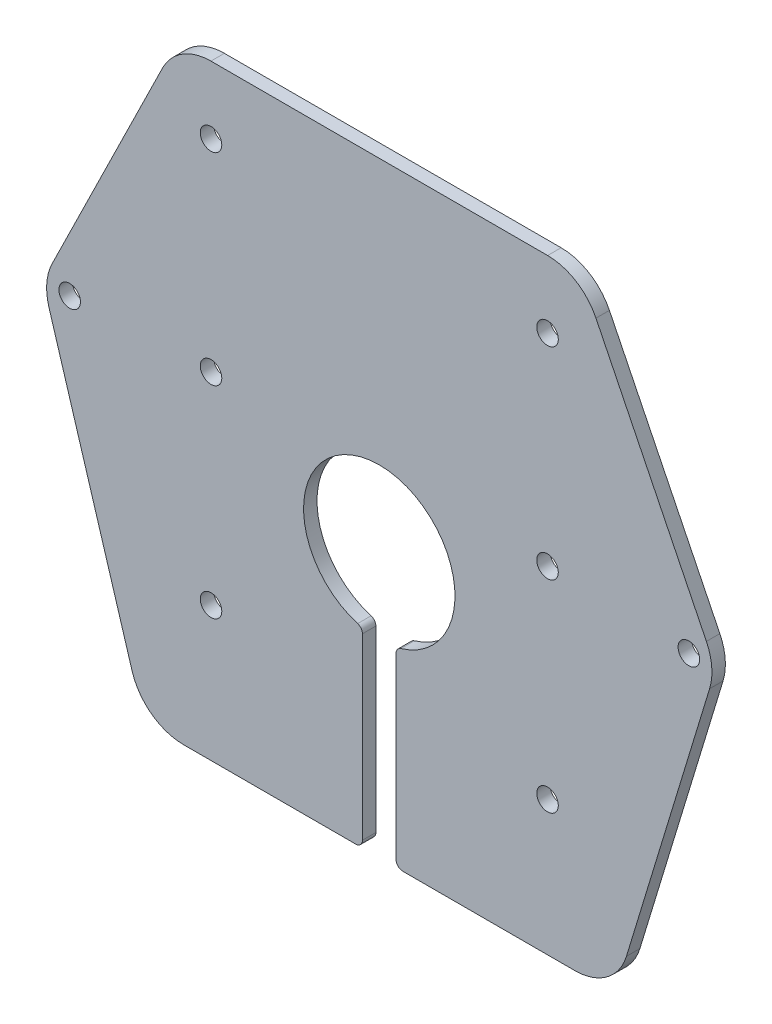
ISO-10303-21;
HEADER;
FILE_DESCRIPTION(('STEP AP214'),'2;1');
FILE_NAME('part.step','',(''),(''),'','','');
FILE_SCHEMA(('AUTOMOTIVE_DESIGN { 1 0 10303 214 1 1 1 1 }'));
ENDSEC;
DATA;
#1=APPLICATION_CONTEXT('core data for automotive mechanical design processes');
#2=APPLICATION_PROTOCOL_DEFINITION('international standard','automotive_design',2000,#1);
#3=PRODUCT_CONTEXT('',#1,'mechanical');
#4=PRODUCT('Part','Part','',(#3));
#5=PRODUCT_RELATED_PRODUCT_CATEGORY('part','',(#4));
#6=PRODUCT_DEFINITION_FORMATION('','',#4);
#7=PRODUCT_DEFINITION_CONTEXT('part definition',#1,'design');
#8=PRODUCT_DEFINITION('design','',#6,#7);
#9=PRODUCT_DEFINITION_SHAPE('','',#8);
#10=(LENGTH_UNIT() NAMED_UNIT(*) SI_UNIT(.MILLI.,.METRE.));
#11=(NAMED_UNIT(*) PLANE_ANGLE_UNIT() SI_UNIT($,.RADIAN.));
#12=(NAMED_UNIT(*) SI_UNIT($,.STERADIAN.) SOLID_ANGLE_UNIT());
#13=UNCERTAINTY_MEASURE_WITH_UNIT(LENGTH_MEASURE(1.E-05),#10,'distance_accuracy_value','');
#14=(GEOMETRIC_REPRESENTATION_CONTEXT(3) GLOBAL_UNCERTAINTY_ASSIGNED_CONTEXT((#13)) GLOBAL_UNIT_ASSIGNED_CONTEXT((#10,
#11,#12)) REPRESENTATION_CONTEXT('',''));
#15=CARTESIAN_POINT('',(0.,0.,0.));
#16=DIRECTION('',(0.,0.,1.));
#17=DIRECTION('',(1.,0.,0.));
#18=AXIS2_PLACEMENT_3D('',#15,#16,#17);
#19=CARTESIAN_POINT('',(35.,-90.,2.));
#20=DIRECTION('',(0.,1.,0.));
#21=DIRECTION('',(0.,0.,1.));
#22=AXIS2_PLACEMENT_3D('',#19,#20,#21);
#23=PLANE('',#22);
#24=DIRECTION('',(1.,0.,0.));
#25=VECTOR('',#24,1.);
#26=CARTESIAN_POINT('',(35.,-90.,0.));
#27=LINE('',#26,#25);
#28=CARTESIAN_POINT('',(-29.0719761931437,-90.,0.));
#29=VERTEX_POINT('',#28);
#30=CARTESIAN_POINT('',(-3.49999999999999,-90.,0.));
#31=VERTEX_POINT('',#30);
#32=EDGE_CURVE('E223',#29,#31,#27,.T.);
#33=ORIENTED_EDGE('',*,*,#32,.T.);
#34=DIRECTION('',(0.,0.,-1.));
#35=VECTOR('',#34,1.);
#36=CARTESIAN_POINT('',(-3.49999999999999,-90.,2.));
#37=LINE('',#36,#35);
#38=CARTESIAN_POINT('',(-3.49999999999999,-90.,2.));
#39=VERTEX_POINT('',#38);
#40=EDGE_CURVE('E12',#31,#39,#37,.F.);
#41=ORIENTED_EDGE('',*,*,#40,.T.);
#42=DIRECTION('',(1.,0.,0.));
#43=VECTOR('',#42,1.);
#44=CARTESIAN_POINT('',(35.,-90.,2.));
#45=LINE('',#44,#43);
#46=CARTESIAN_POINT('',(-29.0719761931437,-90.,2.));
#47=VERTEX_POINT('',#46);
#48=EDGE_CURVE('E329',#47,#39,#45,.T.);
#49=ORIENTED_EDGE('',*,*,#48,.F.);
#50=DIRECTION('',(0.,0.,-1.));
#51=VECTOR('',#50,1.);
#52=CARTESIAN_POINT('',(-29.0719761931437,-90.,2.));
#53=LINE('',#52,#51);
#54=EDGE_CURVE('E203',#47,#29,#53,.T.);
#55=ORIENTED_EDGE('',*,*,#54,.T.);
#56=EDGE_LOOP('',(#33,#41,#49,#55));
#57=FACE_BOUND('',#56,.T.);
#58=ADVANCED_FACE('F55',(#57),#23,.F.);
#59=CARTESIAN_POINT('',(0.,0.,2.));
#60=DIRECTION('',(0.,0.,-1.));
#61=DIRECTION('',(-1.,0.,0.));
#62=AXIS2_PLACEMENT_3D('',#59,#60,#61);
#63=PLANE('',#62);
#64=CARTESIAN_POINT('',(0.,-50.7,2.));
#65=DIRECTION('',(0.,0.,1.));
#66=DIRECTION('',(1.,0.,0.));
#67=AXIS2_PLACEMENT_3D('',#64,#65,#66);
#68=CIRCLE('',#67,11.25);
#69=CARTESIAN_POINT('',(3.21428571428572,-61.481042034374,2.));
#70=VERTEX_POINT('',#69);
#71=CARTESIAN_POINT('',(-3.21428571428571,-61.481042034374,2.));
#72=VERTEX_POINT('',#71);
#73=EDGE_CURVE('E392',#70,#72,#68,.T.);
#74=ORIENTED_EDGE('',*,*,#73,.F.);
#75=CARTESIAN_POINT('',(3.50000000000001,-62.4393568818739,2.));
#76=DIRECTION('',(0.,0.,-1.));
#77=DIRECTION('',(-1.,0.,0.));
#78=AXIS2_PLACEMENT_3D('',#75,#76,#77);
#79=CIRCLE('',#78,1.);
#80=CARTESIAN_POINT('',(2.50000000000001,-62.4393568818739,2.));
#81=VERTEX_POINT('',#80);
#82=EDGE_CURVE('E289',#70,#81,#79,.F.);
#83=ORIENTED_EDGE('',*,*,#82,.T.);
#84=DIRECTION('',(0.,1.,0.));
#85=VECTOR('',#84,1.);
#86=CARTESIAN_POINT('',(2.5,0.,2.));
#87=LINE('',#86,#85);
#88=CARTESIAN_POINT('',(2.50000000000001,-89.,2.));
#89=VERTEX_POINT('',#88);
#90=EDGE_CURVE('E391',#89,#81,#87,.T.);
#91=ORIENTED_EDGE('',*,*,#90,.F.);
#92=CARTESIAN_POINT('',(3.50000000000001,-89.,2.));
#93=DIRECTION('',(0.,0.,-1.));
#94=DIRECTION('',(-1.,0.,0.));
#95=AXIS2_PLACEMENT_3D('',#92,#93,#94);
#96=CIRCLE('',#95,1.);
#97=CARTESIAN_POINT('',(3.50000000000001,-90.,2.));
#98=VERTEX_POINT('',#97);
#99=EDGE_CURVE('E285',#89,#98,#96,.F.);
#100=ORIENTED_EDGE('',*,*,#99,.T.);
#101=CARTESIAN_POINT('',(29.0719761931437,-90.,2.));
#102=VERTEX_POINT('',#101);
#103=EDGE_CURVE('E309',#98,#102,#45,.T.);
#104=ORIENTED_EDGE('',*,*,#103,.T.);
#105=CARTESIAN_POINT('',(29.0719761931437,-82.,2.));
#106=DIRECTION('',(0.,0.,-1.));
#107=DIRECTION('',(-1.,0.,0.));
#108=AXIS2_PLACEMENT_3D('',#105,#106,#107);
#109=CIRCLE('',#108,8.);
#110=CARTESIAN_POINT('',(36.7255552246317,-84.3286751617104,2.));
#111=VERTEX_POINT('',#110);
#112=EDGE_CURVE('E253',#102,#111,#109,.F.);
#113=ORIENTED_EDGE('',*,*,#112,.T.);
#114=DIRECTION('',(0.291084395213794,0.956697378936004,0.));
#115=VECTOR('',#114,1.);
#116=CARTESIAN_POINT('',(50.,-40.7,2.));
#117=LINE('',#116,#115);
#118=CARTESIAN_POINT('',(49.08054040478,-43.7219572029563,2.));
#119=VERTEX_POINT('',#118);
#120=EDGE_CURVE('E213',#111,#119,#117,.T.);
#121=ORIENTED_EDGE('',*,*,#120,.T.);
#122=CARTESIAN_POINT('',(41.426961373292,-41.393282041246,2.));
#123=DIRECTION('',(0.,0.,-1.));
#124=DIRECTION('',(-1.,0.,0.));
#125=AXIS2_PLACEMENT_3D('',#122,#123,#124);
#126=CIRCLE('',#125,8.);
#127=CARTESIAN_POINT('',(48.6069060053251,-37.8650537208366,2.));
#128=VERTEX_POINT('',#127);
#129=EDGE_CURVE('E245',#119,#128,#126,.F.);
#130=ORIENTED_EDGE('',*,*,#129,.T.);
#131=DIRECTION('',(-0.441028540051174,0.897493079004139,0.));
#132=VECTOR('',#131,1.);
#133=CARTESIAN_POINT('',(30.,0.,2.));
#134=LINE('',#133,#132);
#135=CARTESIAN_POINT('',(32.1974308007816,-4.4717716795906,2.));
#136=VERTEX_POINT('',#135);
#137=EDGE_CURVE('E222',#128,#136,#134,.T.);
#138=ORIENTED_EDGE('',*,*,#137,.T.);
#139=CARTESIAN_POINT('',(25.0174861687485,-8.,2.));
#140=DIRECTION('',(0.,0.,-1.));
#141=DIRECTION('',(-1.,0.,0.));
#142=AXIS2_PLACEMENT_3D('',#139,#140,#141);
#143=CIRCLE('',#142,8.);
#144=CARTESIAN_POINT('',(25.0174861687485,0.,2.));
#145=VERTEX_POINT('',#144);
#146=EDGE_CURVE('E249',#136,#145,#143,.F.);
#147=ORIENTED_EDGE('',*,*,#146,.T.);
#148=DIRECTION('',(-1.,0.,0.));
#149=VECTOR('',#148,1.);
#150=CARTESIAN_POINT('',(-30.,0.,2.));
#151=LINE('',#150,#149);
#152=CARTESIAN_POINT('',(-25.0174861687485,0.,2.));
#153=VERTEX_POINT('',#152);
#154=EDGE_CURVE('E226',#145,#153,#151,.T.);
#155=ORIENTED_EDGE('',*,*,#154,.T.);
#156=CARTESIAN_POINT('',(-25.0174861687485,-8.,2.));
#157=DIRECTION('',(0.,0.,-1.));
#158=DIRECTION('',(-1.,0.,0.));
#159=AXIS2_PLACEMENT_3D('',#156,#157,#158);
#160=CIRCLE('',#159,8.);
#161=CARTESIAN_POINT('',(-32.1974308007816,-4.4717716795906,2.));
#162=VERTEX_POINT('',#161);
#163=EDGE_CURVE('E247',#153,#162,#160,.F.);
#164=ORIENTED_EDGE('',*,*,#163,.T.);
#165=DIRECTION('',(-0.441028540051174,-0.897493079004139,0.));
#166=VECTOR('',#165,1.);
#167=CARTESIAN_POINT('',(-30.,0.,2.));
#168=LINE('',#167,#166);
#169=CARTESIAN_POINT('',(-48.6069060053251,-37.8650537208366,2.));
#170=VERTEX_POINT('',#169);
#171=EDGE_CURVE('E335',#162,#170,#168,.T.);
#172=ORIENTED_EDGE('',*,*,#171,.T.);
#173=CARTESIAN_POINT('',(-41.426961373292,-41.393282041246,2.));
#174=DIRECTION('',(0.,0.,-1.));
#175=DIRECTION('',(-1.,0.,0.));
#176=AXIS2_PLACEMENT_3D('',#173,#174,#175);
#177=CIRCLE('',#176,8.);
#178=CARTESIAN_POINT('',(-49.08054040478,-43.7219572029563,2.));
#179=VERTEX_POINT('',#178);
#180=EDGE_CURVE('E243',#170,#179,#177,.F.);
#181=ORIENTED_EDGE('',*,*,#180,.T.);
#182=DIRECTION('',(0.291084395213794,-0.956697378936004,0.));
#183=VECTOR('',#182,1.);
#184=CARTESIAN_POINT('',(-50.,-40.7,2.));
#185=LINE('',#184,#183);
#186=CARTESIAN_POINT('',(-36.7255552246317,-84.3286751617104,2.));
#187=VERTEX_POINT('',#186);
#188=EDGE_CURVE('E332',#179,#187,#185,.T.);
#189=ORIENTED_EDGE('',*,*,#188,.T.);
#190=CARTESIAN_POINT('',(-29.0719761931437,-82.,2.));
#191=DIRECTION('',(0.,0.,-1.));
#192=DIRECTION('',(-1.,0.,0.));
#193=AXIS2_PLACEMENT_3D('',#190,#191,#192);
#194=CIRCLE('',#193,8.);
#195=EDGE_CURVE('E251',#187,#47,#194,.F.);
#196=ORIENTED_EDGE('',*,*,#195,.T.);
#197=ORIENTED_EDGE('',*,*,#48,.T.);
#198=CARTESIAN_POINT('',(-3.49999999999999,-89.,2.));
#199=DIRECTION('',(0.,0.,-1.));
#200=DIRECTION('',(-1.,0.,0.));
#201=AXIS2_PLACEMENT_3D('',#198,#199,#200);
#202=CIRCLE('',#201,1.);
#203=CARTESIAN_POINT('',(-2.49999999999999,-89.,2.));
#204=VERTEX_POINT('',#203);
#205=EDGE_CURVE('E283',#39,#204,#202,.F.);
#206=ORIENTED_EDGE('',*,*,#205,.T.);
#207=DIRECTION('',(0.,1.,0.));
#208=VECTOR('',#207,1.);
#209=CARTESIAN_POINT('',(-2.5,0.,2.));
#210=LINE('',#209,#208);
#211=CARTESIAN_POINT('',(-2.49999999999999,-62.4393568818739,2.));
#212=VERTEX_POINT('',#211);
#213=EDGE_CURVE('E395',#204,#212,#210,.T.);
#214=ORIENTED_EDGE('',*,*,#213,.T.);
#215=CARTESIAN_POINT('',(-3.49999999999999,-62.4393568818739,2.));
#216=DIRECTION('',(0.,0.,-1.));
#217=DIRECTION('',(-1.,0.,0.));
#218=AXIS2_PLACEMENT_3D('',#215,#216,#217);
#219=CIRCLE('',#218,1.);
#220=EDGE_CURVE('E287',#212,#72,#219,.F.);
#221=ORIENTED_EDGE('',*,*,#220,.T.);
#222=EDGE_LOOP('',(#74,#83,#91,#100,#104,#113,#121,#130,#138,#147,#155,#164,#172,#181,#189,#196,
#197,#206,#214,#221));
#223=FACE_BOUND('',#222,.T.);
#224=CARTESIAN_POINT('',(-25.,-9.99999999999999,2.));
#225=DIRECTION('',(0.,0.,1.));
#226=DIRECTION('',(1.,0.,0.));
#227=AXIS2_PLACEMENT_3D('',#224,#225,#226);
#228=CIRCLE('',#227,1.6);
#229=CARTESIAN_POINT('',(-23.4,-9.99999999999999,2.));
#230=VERTEX_POINT('',#229);
#231=EDGE_CURVE('E327',#230,#230,#228,.T.);
#232=ORIENTED_EDGE('',*,*,#231,.F.);
#233=EDGE_LOOP('',(#232));
#234=FACE_BOUND('',#233,.T.);
#235=CARTESIAN_POINT('',(-46.,-40.7,2.));
#236=DIRECTION('',(0.,0.,1.));
#237=DIRECTION('',(1.,0.,0.));
#238=AXIS2_PLACEMENT_3D('',#235,#236,#237);
#239=CIRCLE('',#238,1.6);
#240=CARTESIAN_POINT('',(-44.4,-40.7,2.));
#241=VERTEX_POINT('',#240);
#242=EDGE_CURVE('E343',#241,#241,#239,.T.);
#243=ORIENTED_EDGE('',*,*,#242,.F.);
#244=EDGE_LOOP('',(#243));
#245=FACE_BOUND('',#244,.T.);
#246=CARTESIAN_POINT('',(25.,-9.99999999999999,2.));
#247=DIRECTION('',(0.,0.,1.));
#248=DIRECTION('',(-1.,0.,0.));
#249=AXIS2_PLACEMENT_3D('',#246,#247,#248);
#250=CIRCLE('',#249,1.6);
#251=CARTESIAN_POINT('',(23.4,-9.99999999999999,2.));
#252=VERTEX_POINT('',#251);
#253=EDGE_CURVE('E349',#252,#252,#250,.T.);
#254=ORIENTED_EDGE('',*,*,#253,.F.);
#255=EDGE_LOOP('',(#254));
#256=FACE_BOUND('',#255,.T.);
#257=CARTESIAN_POINT('',(46.,-40.7,2.));
#258=DIRECTION('',(0.,0.,1.));
#259=DIRECTION('',(-1.,0.,0.));
#260=AXIS2_PLACEMENT_3D('',#257,#258,#259);
#261=CIRCLE('',#260,1.6);
#262=CARTESIAN_POINT('',(44.4,-40.7,2.));
#263=VERTEX_POINT('',#262);
#264=EDGE_CURVE('E355',#263,#263,#261,.T.);
#265=ORIENTED_EDGE('',*,*,#264,.F.);
#266=EDGE_LOOP('',(#265));
#267=FACE_BOUND('',#266,.T.);
#268=CARTESIAN_POINT('',(-25.,-40.,2.));
#269=DIRECTION('',(0.,0.,1.));
#270=DIRECTION('',(1.,0.,0.));
#271=AXIS2_PLACEMENT_3D('',#268,#269,#270);
#272=CIRCLE('',#271,1.6);
#273=CARTESIAN_POINT('',(-23.4,-40.,2.));
#274=VERTEX_POINT('',#273);
#275=EDGE_CURVE('E361',#274,#274,#272,.T.);
#276=ORIENTED_EDGE('',*,*,#275,.F.);
#277=EDGE_LOOP('',(#276));
#278=FACE_BOUND('',#277,.T.);
#279=CARTESIAN_POINT('',(25.,-40.,2.));
#280=DIRECTION('',(0.,0.,1.));
#281=DIRECTION('',(1.,0.,0.));
#282=AXIS2_PLACEMENT_3D('',#279,#280,#281);
#283=CIRCLE('',#282,1.6);
#284=CARTESIAN_POINT('',(26.6,-40.,2.));
#285=VERTEX_POINT('',#284);
#286=EDGE_CURVE('E367',#285,#285,#283,.T.);
#287=ORIENTED_EDGE('',*,*,#286,.F.);
#288=EDGE_LOOP('',(#287));
#289=FACE_BOUND('',#288,.T.);
#290=CARTESIAN_POINT('',(-25.,-70.,2.));
#291=DIRECTION('',(0.,0.,1.));
#292=DIRECTION('',(1.,0.,0.));
#293=AXIS2_PLACEMENT_3D('',#290,#291,#292);
#294=CIRCLE('',#293,1.60000000000001);
#295=CARTESIAN_POINT('',(-23.4,-70.,2.));
#296=VERTEX_POINT('',#295);
#297=EDGE_CURVE('E373',#296,#296,#294,.T.);
#298=ORIENTED_EDGE('',*,*,#297,.F.);
#299=EDGE_LOOP('',(#298));
#300=FACE_BOUND('',#299,.T.);
#301=CARTESIAN_POINT('',(25.,-70.,2.));
#302=DIRECTION('',(0.,0.,1.));
#303=DIRECTION('',(-1.,0.,0.));
#304=AXIS2_PLACEMENT_3D('',#301,#302,#303);
#305=CIRCLE('',#304,1.60000000000001);
#306=CARTESIAN_POINT('',(23.4,-70.,2.));
#307=VERTEX_POINT('',#306);
#308=EDGE_CURVE('E379',#307,#307,#305,.T.);
#309=ORIENTED_EDGE('',*,*,#308,.F.);
#310=EDGE_LOOP('',(#309));
#311=FACE_BOUND('',#310,.T.);
#312=ADVANCED_FACE('F402',(#223,#234,#245,#256,#267,#278,#289,#300,#311),#63,.F.);
#313=CARTESIAN_POINT('',(0.,0.,0.));
#314=DIRECTION('',(0.,0.,-1.));
#315=DIRECTION('',(-1.,0.,0.));
#316=AXIS2_PLACEMENT_3D('',#313,#314,#315);
#317=PLANE('',#316);
#318=DIRECTION('',(0.,-1.,0.));
#319=VECTOR('',#318,1.);
#320=CARTESIAN_POINT('',(2.5,0.,0.));
#321=LINE('',#320,#319);
#322=CARTESIAN_POINT('',(2.50000000000001,-62.4393568818739,0.));
#323=VERTEX_POINT('',#322);
#324=CARTESIAN_POINT('',(2.50000000000001,-89.,0.));
#325=VERTEX_POINT('',#324);
#326=EDGE_CURVE('E385',#323,#325,#321,.T.);
#327=ORIENTED_EDGE('',*,*,#326,.F.);
#328=CARTESIAN_POINT('',(3.50000000000001,-62.4393568818739,0.));
#329=DIRECTION('',(0.,0.,-1.));
#330=DIRECTION('',(-1.,0.,0.));
#331=AXIS2_PLACEMENT_3D('',#328,#329,#330);
#332=CIRCLE('',#331,1.);
#333=CARTESIAN_POINT('',(3.21428571428572,-61.481042034374,0.));
#334=VERTEX_POINT('',#333);
#335=EDGE_CURVE('E299',#323,#334,#332,.T.);
#336=ORIENTED_EDGE('',*,*,#335,.T.);
#337=CARTESIAN_POINT('',(0.,-50.7,0.));
#338=DIRECTION('',(0.,0.,-1.));
#339=DIRECTION('',(-1.,0.,0.));
#340=AXIS2_PLACEMENT_3D('',#337,#338,#339);
#341=CIRCLE('',#340,11.25);
#342=CARTESIAN_POINT('',(-3.21428571428571,-61.481042034374,0.));
#343=VERTEX_POINT('',#342);
#344=EDGE_CURVE('E275',#343,#334,#341,.T.);
#345=ORIENTED_EDGE('',*,*,#344,.F.);
#346=CARTESIAN_POINT('',(-3.49999999999999,-62.4393568818739,0.));
#347=DIRECTION('',(0.,0.,-1.));
#348=DIRECTION('',(-1.,0.,0.));
#349=AXIS2_PLACEMENT_3D('',#346,#347,#348);
#350=CIRCLE('',#349,1.);
#351=CARTESIAN_POINT('',(-2.49999999999999,-62.4393568818739,0.));
#352=VERTEX_POINT('',#351);
#353=EDGE_CURVE('E297',#343,#352,#350,.T.);
#354=ORIENTED_EDGE('',*,*,#353,.T.);
#355=DIRECTION('',(0.,-1.,0.));
#356=VECTOR('',#355,1.);
#357=CARTESIAN_POINT('',(-2.5,0.,0.));
#358=LINE('',#357,#356);
#359=CARTESIAN_POINT('',(-2.49999999999999,-89.,0.));
#360=VERTEX_POINT('',#359);
#361=EDGE_CURVE('E389',#352,#360,#358,.T.);
#362=ORIENTED_EDGE('',*,*,#361,.T.);
#363=CARTESIAN_POINT('',(-3.49999999999999,-89.,0.));
#364=DIRECTION('',(0.,0.,-1.));
#365=DIRECTION('',(-1.,0.,0.));
#366=AXIS2_PLACEMENT_3D('',#363,#364,#365);
#367=CIRCLE('',#366,1.);
#368=EDGE_CURVE('E78',#360,#31,#367,.T.);
#369=ORIENTED_EDGE('',*,*,#368,.T.);
#370=ORIENTED_EDGE('',*,*,#32,.F.);
#371=CARTESIAN_POINT('',(-29.0719761931437,-82.,0.));
#372=DIRECTION('',(0.,0.,-1.));
#373=DIRECTION('',(-1.,0.,0.));
#374=AXIS2_PLACEMENT_3D('',#371,#372,#373);
#375=CIRCLE('',#374,8.);
#376=CARTESIAN_POINT('',(-36.7255552246317,-84.3286751617104,0.));
#377=VERTEX_POINT('',#376);
#378=EDGE_CURVE('E204',#29,#377,#375,.T.);
#379=ORIENTED_EDGE('',*,*,#378,.T.);
#380=DIRECTION('',(0.291084395213794,-0.956697378936004,0.));
#381=VECTOR('',#380,1.);
#382=CARTESIAN_POINT('',(-50.,-40.7,0.));
#383=LINE('',#382,#381);
#384=CARTESIAN_POINT('',(-49.08054040478,-43.7219572029563,0.));
#385=VERTEX_POINT('',#384);
#386=EDGE_CURVE('E312',#385,#377,#383,.T.);
#387=ORIENTED_EDGE('',*,*,#386,.F.);
#388=CARTESIAN_POINT('',(-41.426961373292,-41.393282041246,0.));
#389=DIRECTION('',(0.,0.,-1.));
#390=DIRECTION('',(-1.,0.,0.));
#391=AXIS2_PLACEMENT_3D('',#388,#389,#390);
#392=CIRCLE('',#391,8.);
#393=CARTESIAN_POINT('',(-48.6069060053251,-37.8650537208366,0.));
#394=VERTEX_POINT('',#393);
#395=EDGE_CURVE('E214',#385,#394,#392,.T.);
#396=ORIENTED_EDGE('',*,*,#395,.T.);
#397=DIRECTION('',(-0.441028540051174,-0.897493079004139,0.));
#398=VECTOR('',#397,1.);
#399=CARTESIAN_POINT('',(-30.,0.,0.));
#400=LINE('',#399,#398);
#401=CARTESIAN_POINT('',(-32.1974308007816,-4.4717716795906,0.));
#402=VERTEX_POINT('',#401);
#403=EDGE_CURVE('E314',#402,#394,#400,.T.);
#404=ORIENTED_EDGE('',*,*,#403,.F.);
#405=CARTESIAN_POINT('',(-25.0174861687485,-8.,0.));
#406=DIRECTION('',(0.,0.,-1.));
#407=DIRECTION('',(-1.,0.,0.));
#408=AXIS2_PLACEMENT_3D('',#405,#406,#407);
#409=CIRCLE('',#408,8.);
#410=CARTESIAN_POINT('',(-25.0174861687485,0.,0.));
#411=VERTEX_POINT('',#410);
#412=EDGE_CURVE('E235',#402,#411,#409,.T.);
#413=ORIENTED_EDGE('',*,*,#412,.T.);
#414=DIRECTION('',(-1.,0.,0.));
#415=VECTOR('',#414,1.);
#416=CARTESIAN_POINT('',(-30.,0.,0.));
#417=LINE('',#416,#415);
#418=CARTESIAN_POINT('',(25.0174861687485,0.,0.));
#419=VERTEX_POINT('',#418);
#420=EDGE_CURVE('E319',#419,#411,#417,.T.);
#421=ORIENTED_EDGE('',*,*,#420,.F.);
#422=CARTESIAN_POINT('',(25.0174861687485,-8.,0.));
#423=DIRECTION('',(0.,0.,-1.));
#424=DIRECTION('',(-1.,0.,0.));
#425=AXIS2_PLACEMENT_3D('',#422,#423,#424);
#426=CIRCLE('',#425,8.);
#427=CARTESIAN_POINT('',(32.1974308007816,-4.4717716795906,0.));
#428=VERTEX_POINT('',#427);
#429=EDGE_CURVE('E237',#419,#428,#426,.T.);
#430=ORIENTED_EDGE('',*,*,#429,.T.);
#431=DIRECTION('',(-0.441028540051174,0.897493079004139,0.));
#432=VECTOR('',#431,1.);
#433=CARTESIAN_POINT('',(30.,0.,0.));
#434=LINE('',#433,#432);
#435=CARTESIAN_POINT('',(48.6069060053251,-37.8650537208366,0.));
#436=VERTEX_POINT('',#435);
#437=EDGE_CURVE('E324',#436,#428,#434,.T.);
#438=ORIENTED_EDGE('',*,*,#437,.F.);
#439=CARTESIAN_POINT('',(41.426961373292,-41.393282041246,0.));
#440=DIRECTION('',(0.,0.,-1.));
#441=DIRECTION('',(-1.,0.,0.));
#442=AXIS2_PLACEMENT_3D('',#439,#440,#441);
#443=CIRCLE('',#442,8.);
#444=CARTESIAN_POINT('',(49.08054040478,-43.7219572029563,0.));
#445=VERTEX_POINT('',#444);
#446=EDGE_CURVE('E221',#436,#445,#443,.T.);
#447=ORIENTED_EDGE('',*,*,#446,.T.);
#448=DIRECTION('',(0.291084395213794,0.956697378936004,0.));
#449=VECTOR('',#448,1.);
#450=CARTESIAN_POINT('',(50.,-40.7,0.));
#451=LINE('',#450,#449);
#452=CARTESIAN_POINT('',(36.7255552246317,-84.3286751617104,0.));
#453=VERTEX_POINT('',#452);
#454=EDGE_CURVE('E210',#453,#445,#451,.T.);
#455=ORIENTED_EDGE('',*,*,#454,.F.);
#456=CARTESIAN_POINT('',(29.0719761931437,-82.,0.));
#457=DIRECTION('',(0.,0.,-1.));
#458=DIRECTION('',(-1.,0.,0.));
#459=AXIS2_PLACEMENT_3D('',#456,#457,#458);
#460=CIRCLE('',#459,8.);
#461=CARTESIAN_POINT('',(29.0719761931437,-90.,0.));
#462=VERTEX_POINT('',#461);
#463=EDGE_CURVE('E194',#453,#462,#460,.T.);
#464=ORIENTED_EDGE('',*,*,#463,.T.);
#465=CARTESIAN_POINT('',(3.50000000000001,-90.,0.));
#466=VERTEX_POINT('',#465);
#467=EDGE_CURVE('E228',#466,#462,#27,.T.);
#468=ORIENTED_EDGE('',*,*,#467,.F.);
#469=CARTESIAN_POINT('',(3.50000000000001,-89.,0.));
#470=DIRECTION('',(0.,0.,-1.));
#471=DIRECTION('',(-1.,0.,0.));
#472=AXIS2_PLACEMENT_3D('',#469,#470,#471);
#473=CIRCLE('',#472,1.);
#474=EDGE_CURVE('E70',#466,#325,#473,.T.);
#475=ORIENTED_EDGE('',*,*,#474,.T.);
#476=EDGE_LOOP('',(#327,#336,#345,#354,#362,#369,#370,#379,#387,#396,#404,#413,#421,#430,#438,
#447,#455,#464,#468,#475));
#477=FACE_BOUND('',#476,.T.);
#478=CARTESIAN_POINT('',(-25.,-70.,0.));
#479=DIRECTION('',(0.,0.,1.));
#480=DIRECTION('',(1.,0.,0.));
#481=AXIS2_PLACEMENT_3D('',#478,#479,#480);
#482=CIRCLE('',#481,1.60000000000001);
#483=CARTESIAN_POINT('',(-23.4,-70.,0.));
#484=VERTEX_POINT('',#483);
#485=EDGE_CURVE('E376',#484,#484,#482,.T.);
#486=ORIENTED_EDGE('',*,*,#485,.T.);
#487=EDGE_LOOP('',(#486));
#488=FACE_BOUND('',#487,.T.);
#489=CARTESIAN_POINT('',(-25.,-40.,0.));
#490=DIRECTION('',(0.,0.,1.));
#491=DIRECTION('',(1.,0.,0.));
#492=AXIS2_PLACEMENT_3D('',#489,#490,#491);
#493=CIRCLE('',#492,1.6);
#494=CARTESIAN_POINT('',(-23.4,-40.,0.));
#495=VERTEX_POINT('',#494);
#496=EDGE_CURVE('E364',#495,#495,#493,.T.);
#497=ORIENTED_EDGE('',*,*,#496,.T.);
#498=EDGE_LOOP('',(#497));
#499=FACE_BOUND('',#498,.T.);
#500=CARTESIAN_POINT('',(25.,-9.99999999999999,0.));
#501=DIRECTION('',(0.,0.,1.));
#502=DIRECTION('',(-1.,0.,0.));
#503=AXIS2_PLACEMENT_3D('',#500,#501,#502);
#504=CIRCLE('',#503,1.6);
#505=CARTESIAN_POINT('',(23.4,-9.99999999999999,0.));
#506=VERTEX_POINT('',#505);
#507=EDGE_CURVE('E352',#506,#506,#504,.T.);
#508=ORIENTED_EDGE('',*,*,#507,.T.);
#509=EDGE_LOOP('',(#508));
#510=FACE_BOUND('',#509,.T.);
#511=CARTESIAN_POINT('',(-25.,-9.99999999999999,0.));
#512=DIRECTION('',(0.,0.,1.));
#513=DIRECTION('',(1.,0.,0.));
#514=AXIS2_PLACEMENT_3D('',#511,#512,#513);
#515=CIRCLE('',#514,1.6);
#516=CARTESIAN_POINT('',(-23.4,-9.99999999999999,0.));
#517=VERTEX_POINT('',#516);
#518=EDGE_CURVE('E340',#517,#517,#515,.T.);
#519=ORIENTED_EDGE('',*,*,#518,.T.);
#520=EDGE_LOOP('',(#519));
#521=FACE_BOUND('',#520,.T.);
#522=CARTESIAN_POINT('',(-46.,-40.7,0.));
#523=DIRECTION('',(0.,0.,1.));
#524=DIRECTION('',(1.,0.,0.));
#525=AXIS2_PLACEMENT_3D('',#522,#523,#524);
#526=CIRCLE('',#525,1.6);
#527=CARTESIAN_POINT('',(-44.4,-40.7,0.));
#528=VERTEX_POINT('',#527);
#529=EDGE_CURVE('E346',#528,#528,#526,.T.);
#530=ORIENTED_EDGE('',*,*,#529,.T.);
#531=EDGE_LOOP('',(#530));
#532=FACE_BOUND('',#531,.T.);
#533=CARTESIAN_POINT('',(46.,-40.7,0.));
#534=DIRECTION('',(0.,0.,1.));
#535=DIRECTION('',(-1.,0.,0.));
#536=AXIS2_PLACEMENT_3D('',#533,#534,#535);
#537=CIRCLE('',#536,1.6);
#538=CARTESIAN_POINT('',(44.4,-40.7,0.));
#539=VERTEX_POINT('',#538);
#540=EDGE_CURVE('E358',#539,#539,#537,.T.);
#541=ORIENTED_EDGE('',*,*,#540,.T.);
#542=EDGE_LOOP('',(#541));
#543=FACE_BOUND('',#542,.T.);
#544=CARTESIAN_POINT('',(25.,-40.,0.));
#545=DIRECTION('',(0.,0.,1.));
#546=DIRECTION('',(1.,0.,0.));
#547=AXIS2_PLACEMENT_3D('',#544,#545,#546);
#548=CIRCLE('',#547,1.6);
#549=CARTESIAN_POINT('',(26.6,-40.,0.));
#550=VERTEX_POINT('',#549);
#551=EDGE_CURVE('E370',#550,#550,#548,.T.);
#552=ORIENTED_EDGE('',*,*,#551,.T.);
#553=EDGE_LOOP('',(#552));
#554=FACE_BOUND('',#553,.T.);
#555=CARTESIAN_POINT('',(25.,-70.,0.));
#556=DIRECTION('',(0.,0.,1.));
#557=DIRECTION('',(-1.,0.,0.));
#558=AXIS2_PLACEMENT_3D('',#555,#556,#557);
#559=CIRCLE('',#558,1.60000000000001);
#560=CARTESIAN_POINT('',(23.4,-70.,0.));
#561=VERTEX_POINT('',#560);
#562=EDGE_CURVE('E382',#561,#561,#559,.T.);
#563=ORIENTED_EDGE('',*,*,#562,.T.);
#564=EDGE_LOOP('',(#563));
#565=FACE_BOUND('',#564,.T.);
#566=ADVANCED_FACE('F218',(#477,#488,#499,#510,#521,#532,#543,#554,#565),#317,.T.);
#567=CARTESIAN_POINT('',(30.,0.,2.));
#568=DIRECTION('',(-0.897493079004139,-0.441028540051174,0.));
#569=DIRECTION('',(0.441028540051174,-0.897493079004139,0.));
#570=AXIS2_PLACEMENT_3D('',#567,#568,#569);
#571=PLANE('',#570);
#572=ORIENTED_EDGE('',*,*,#437,.T.);
#573=DIRECTION('',(0.,0.,-1.));
#574=VECTOR('',#573,1.);
#575=CARTESIAN_POINT('',(32.1974308007816,-4.4717716795906,2.));
#576=LINE('',#575,#574);
#577=EDGE_CURVE('E268',#428,#136,#576,.F.);
#578=ORIENTED_EDGE('',*,*,#577,.T.);
#579=ORIENTED_EDGE('',*,*,#137,.F.);
#580=DIRECTION('',(0.,0.,-1.));
#581=VECTOR('',#580,1.);
#582=CARTESIAN_POINT('',(48.6069060053251,-37.8650537208366,2.));
#583=LINE('',#582,#581);
#584=EDGE_CURVE('E265',#128,#436,#583,.T.);
#585=ORIENTED_EDGE('',*,*,#584,.T.);
#586=EDGE_LOOP('',(#572,#578,#579,#585));
#587=FACE_BOUND('',#586,.T.);
#588=ADVANCED_FACE('F449',(#587),#571,.F.);
#589=CARTESIAN_POINT('',(-30.,0.,2.));
#590=DIRECTION('',(0.,-1.,0.));
#591=DIRECTION('',(0.,0.,-1.));
#592=AXIS2_PLACEMENT_3D('',#589,#590,#591);
#593=PLANE('',#592);
#594=ORIENTED_EDGE('',*,*,#154,.F.);
#595=DIRECTION('',(0.,0.,-1.));
#596=VECTOR('',#595,1.);
#597=CARTESIAN_POINT('',(25.0174861687485,0.,2.));
#598=LINE('',#597,#596);
#599=EDGE_CURVE('E262',#145,#419,#598,.T.);
#600=ORIENTED_EDGE('',*,*,#599,.T.);
#601=ORIENTED_EDGE('',*,*,#420,.T.);
#602=DIRECTION('',(0.,0.,-1.));
#603=VECTOR('',#602,1.);
#604=CARTESIAN_POINT('',(-25.0174861687485,0.,2.));
#605=LINE('',#604,#603);
#606=EDGE_CURVE('E260',#411,#153,#605,.F.);
#607=ORIENTED_EDGE('',*,*,#606,.T.);
#608=EDGE_LOOP('',(#594,#600,#601,#607));
#609=FACE_BOUND('',#608,.T.);
#610=ADVANCED_FACE('F437',(#609),#593,.F.);
#611=CARTESIAN_POINT('',(-30.,0.,2.));
#612=DIRECTION('',(0.897493079004139,-0.441028540051174,0.));
#613=DIRECTION('',(0.441028540051174,0.897493079004139,0.));
#614=AXIS2_PLACEMENT_3D('',#611,#612,#613);
#615=PLANE('',#614);
#616=ORIENTED_EDGE('',*,*,#171,.F.);
#617=DIRECTION('',(0.,0.,-1.));
#618=VECTOR('',#617,1.);
#619=CARTESIAN_POINT('',(-32.1974308007816,-4.47177167959061,2.));
#620=LINE('',#619,#618);
#621=EDGE_CURVE('E272',#162,#402,#620,.T.);
#622=ORIENTED_EDGE('',*,*,#621,.T.);
#623=ORIENTED_EDGE('',*,*,#403,.T.);
#624=DIRECTION('',(0.,0.,-1.));
#625=VECTOR('',#624,1.);
#626=CARTESIAN_POINT('',(-48.6069060053251,-37.8650537208366,2.));
#627=LINE('',#626,#625);
#628=EDGE_CURVE('E270',#394,#170,#627,.F.);
#629=ORIENTED_EDGE('',*,*,#628,.T.);
#630=EDGE_LOOP('',(#616,#622,#623,#629));
#631=FACE_BOUND('',#630,.T.);
#632=ADVANCED_FACE('F425',(#631),#615,.F.);
#633=CARTESIAN_POINT('',(-50.,-40.7,2.));
#634=DIRECTION('',(0.956697378936004,0.291084395213794,0.));
#635=DIRECTION('',(-0.291084395213794,0.956697378936004,0.));
#636=AXIS2_PLACEMENT_3D('',#633,#634,#635);
#637=PLANE('',#636);
#638=ORIENTED_EDGE('',*,*,#386,.T.);
#639=DIRECTION('',(0.,0.,-1.));
#640=VECTOR('',#639,1.);
#641=CARTESIAN_POINT('',(-36.7255552246317,-84.3286751617104,2.));
#642=LINE('',#641,#640);
#643=EDGE_CURVE('E258',#377,#187,#642,.F.);
#644=ORIENTED_EDGE('',*,*,#643,.T.);
#645=ORIENTED_EDGE('',*,*,#188,.F.);
#646=DIRECTION('',(0.,0.,-1.));
#647=VECTOR('',#646,1.);
#648=CARTESIAN_POINT('',(-49.08054040478,-43.7219572029563,2.));
#649=LINE('',#648,#647);
#650=EDGE_CURVE('E255',#179,#385,#649,.T.);
#651=ORIENTED_EDGE('',*,*,#650,.T.);
#652=EDGE_LOOP('',(#638,#644,#645,#651));
#653=FACE_BOUND('',#652,.T.);
#654=ADVANCED_FACE('F429',(#653),#637,.F.);
#655=ORIENTED_EDGE('',*,*,#103,.F.);
#656=DIRECTION('',(0.,0.,-1.));
#657=VECTOR('',#656,1.);
#658=CARTESIAN_POINT('',(3.50000000000001,-90.,2.));
#659=LINE('',#658,#657);
#660=EDGE_CURVE('E63',#98,#466,#659,.T.);
#661=ORIENTED_EDGE('',*,*,#660,.T.);
#662=ORIENTED_EDGE('',*,*,#467,.T.);
#663=DIRECTION('',(0.,0.,-1.));
#664=VECTOR('',#663,1.);
#665=CARTESIAN_POINT('',(29.0719761931437,-90.,2.));
#666=LINE('',#665,#664);
#667=EDGE_CURVE('E200',#462,#102,#666,.F.);
#668=ORIENTED_EDGE('',*,*,#667,.T.);
#669=EDGE_LOOP('',(#655,#661,#662,#668));
#670=FACE_BOUND('',#669,.T.);
#671=ADVANCED_FACE('F308',(#670),#23,.F.);
#672=CARTESIAN_POINT('',(50.,-40.7,2.));
#673=DIRECTION('',(-0.956697378936004,0.291084395213794,0.));
#674=DIRECTION('',(-0.291084395213794,-0.956697378936004,0.));
#675=AXIS2_PLACEMENT_3D('',#672,#673,#674);
#676=PLANE('',#675);
#677=ORIENTED_EDGE('',*,*,#120,.F.);
#678=DIRECTION('',(0.,0.,-1.));
#679=VECTOR('',#678,1.);
#680=CARTESIAN_POINT('',(36.7255552246317,-84.3286751617104,2.));
#681=LINE('',#680,#679);
#682=EDGE_CURVE('E198',#111,#453,#681,.T.);
#683=ORIENTED_EDGE('',*,*,#682,.T.);
#684=ORIENTED_EDGE('',*,*,#454,.T.);
#685=DIRECTION('',(0.,0.,-1.));
#686=VECTOR('',#685,1.);
#687=CARTESIAN_POINT('',(49.08054040478,-43.7219572029563,2.));
#688=LINE('',#687,#686);
#689=EDGE_CURVE('E215',#445,#119,#688,.F.);
#690=ORIENTED_EDGE('',*,*,#689,.T.);
#691=EDGE_LOOP('',(#677,#683,#684,#690));
#692=FACE_BOUND('',#691,.T.);
#693=ADVANCED_FACE('F209',(#692),#676,.F.);
#694=CARTESIAN_POINT('',(-25.,-9.99999999999999,2.));
#695=DIRECTION('',(0.,0.,-1.));
#696=DIRECTION('',(-1.,0.,0.));
#697=AXIS2_PLACEMENT_3D('',#694,#695,#696);
#698=CYLINDRICAL_SURFACE('',#697,1.6);
#699=ORIENTED_EDGE('',*,*,#231,.T.);
#700=EDGE_LOOP('',(#699));
#701=FACE_BOUND('',#700,.T.);
#702=ORIENTED_EDGE('',*,*,#518,.F.);
#703=EDGE_LOOP('',(#702));
#704=FACE_BOUND('',#703,.T.);
#705=ADVANCED_FACE('F447',(#701,#704),#698,.F.);
#706=CARTESIAN_POINT('',(-46.,-40.7,2.));
#707=DIRECTION('',(0.,0.,-1.));
#708=DIRECTION('',(-1.,0.,0.));
#709=AXIS2_PLACEMENT_3D('',#706,#707,#708);
#710=CYLINDRICAL_SURFACE('',#709,1.6);
#711=ORIENTED_EDGE('',*,*,#242,.T.);
#712=EDGE_LOOP('',(#711));
#713=FACE_BOUND('',#712,.T.);
#714=ORIENTED_EDGE('',*,*,#529,.F.);
#715=EDGE_LOOP('',(#714));
#716=FACE_BOUND('',#715,.T.);
#717=ADVANCED_FACE('F453',(#713,#716),#710,.F.);
#718=CARTESIAN_POINT('',(25.,-9.99999999999999,2.));
#719=DIRECTION('',(0.,0.,-1.));
#720=DIRECTION('',(-1.,0.,0.));
#721=AXIS2_PLACEMENT_3D('',#718,#719,#720);
#722=CYLINDRICAL_SURFACE('',#721,1.6);
#723=ORIENTED_EDGE('',*,*,#253,.T.);
#724=EDGE_LOOP('',(#723));
#725=FACE_BOUND('',#724,.T.);
#726=ORIENTED_EDGE('',*,*,#507,.F.);
#727=EDGE_LOOP('',(#726));
#728=FACE_BOUND('',#727,.T.);
#729=ADVANCED_FACE('F457',(#725,#728),#722,.F.);
#730=CARTESIAN_POINT('',(46.,-40.7,2.));
#731=DIRECTION('',(0.,0.,-1.));
#732=DIRECTION('',(-1.,0.,0.));
#733=AXIS2_PLACEMENT_3D('',#730,#731,#732);
#734=CYLINDRICAL_SURFACE('',#733,1.6);
#735=ORIENTED_EDGE('',*,*,#264,.T.);
#736=EDGE_LOOP('',(#735));
#737=FACE_BOUND('',#736,.T.);
#738=ORIENTED_EDGE('',*,*,#540,.F.);
#739=EDGE_LOOP('',(#738));
#740=FACE_BOUND('',#739,.T.);
#741=ADVANCED_FACE('F461',(#737,#740),#734,.F.);
#742=CARTESIAN_POINT('',(-25.,-40.,2.));
#743=DIRECTION('',(0.,0.,-1.));
#744=DIRECTION('',(-1.,0.,0.));
#745=AXIS2_PLACEMENT_3D('',#742,#743,#744);
#746=CYLINDRICAL_SURFACE('',#745,1.6);
#747=ORIENTED_EDGE('',*,*,#275,.T.);
#748=EDGE_LOOP('',(#747));
#749=FACE_BOUND('',#748,.T.);
#750=ORIENTED_EDGE('',*,*,#496,.F.);
#751=EDGE_LOOP('',(#750));
#752=FACE_BOUND('',#751,.T.);
#753=ADVANCED_FACE('F465',(#749,#752),#746,.F.);
#754=CARTESIAN_POINT('',(25.,-40.,2.));
#755=DIRECTION('',(0.,0.,-1.));
#756=DIRECTION('',(-1.,0.,0.));
#757=AXIS2_PLACEMENT_3D('',#754,#755,#756);
#758=CYLINDRICAL_SURFACE('',#757,1.6);
#759=ORIENTED_EDGE('',*,*,#286,.T.);
#760=EDGE_LOOP('',(#759));
#761=FACE_BOUND('',#760,.T.);
#762=ORIENTED_EDGE('',*,*,#551,.F.);
#763=EDGE_LOOP('',(#762));
#764=FACE_BOUND('',#763,.T.);
#765=ADVANCED_FACE('F469',(#761,#764),#758,.F.);
#766=CARTESIAN_POINT('',(-25.,-70.,2.));
#767=DIRECTION('',(0.,0.,-1.));
#768=DIRECTION('',(-1.,0.,0.));
#769=AXIS2_PLACEMENT_3D('',#766,#767,#768);
#770=CYLINDRICAL_SURFACE('',#769,1.60000000000001);
#771=ORIENTED_EDGE('',*,*,#297,.T.);
#772=EDGE_LOOP('',(#771));
#773=FACE_BOUND('',#772,.T.);
#774=ORIENTED_EDGE('',*,*,#485,.F.);
#775=EDGE_LOOP('',(#774));
#776=FACE_BOUND('',#775,.T.);
#777=ADVANCED_FACE('F473',(#773,#776),#770,.F.);
#778=CARTESIAN_POINT('',(25.,-70.,2.));
#779=DIRECTION('',(0.,0.,-1.));
#780=DIRECTION('',(-1.,0.,0.));
#781=AXIS2_PLACEMENT_3D('',#778,#779,#780);
#782=CYLINDRICAL_SURFACE('',#781,1.60000000000001);
#783=ORIENTED_EDGE('',*,*,#308,.T.);
#784=EDGE_LOOP('',(#783));
#785=FACE_BOUND('',#784,.T.);
#786=ORIENTED_EDGE('',*,*,#562,.F.);
#787=EDGE_LOOP('',(#786));
#788=FACE_BOUND('',#787,.T.);
#789=ADVANCED_FACE('F477',(#785,#788),#782,.F.);
#790=CARTESIAN_POINT('',(29.0719761931437,-82.,2.));
#791=DIRECTION('',(0.,0.,-1.));
#792=DIRECTION('',(-1.,0.,0.));
#793=AXIS2_PLACEMENT_3D('',#790,#791,#792);
#794=CYLINDRICAL_SURFACE('',#793,8.);
#795=ORIENTED_EDGE('',*,*,#112,.F.);
#796=ORIENTED_EDGE('',*,*,#667,.F.);
#797=ORIENTED_EDGE('',*,*,#463,.F.);
#798=ORIENTED_EDGE('',*,*,#682,.F.);
#799=EDGE_LOOP('',(#795,#796,#797,#798));
#800=FACE_BOUND('',#799,.T.);
#801=ADVANCED_FACE('F197',(#800),#794,.T.);
#802=CARTESIAN_POINT('',(-29.0719761931437,-82.,2.));
#803=DIRECTION('',(0.,0.,-1.));
#804=DIRECTION('',(-1.,0.,0.));
#805=AXIS2_PLACEMENT_3D('',#802,#803,#804);
#806=CYLINDRICAL_SURFACE('',#805,8.);
#807=ORIENTED_EDGE('',*,*,#195,.F.);
#808=ORIENTED_EDGE('',*,*,#643,.F.);
#809=ORIENTED_EDGE('',*,*,#378,.F.);
#810=ORIENTED_EDGE('',*,*,#54,.F.);
#811=EDGE_LOOP('',(#807,#808,#809,#810));
#812=FACE_BOUND('',#811,.T.);
#813=ADVANCED_FACE('F418',(#812),#806,.T.);
#814=CARTESIAN_POINT('',(25.0174861687485,-8.,2.));
#815=DIRECTION('',(0.,0.,-1.));
#816=DIRECTION('',(-1.,0.,0.));
#817=AXIS2_PLACEMENT_3D('',#814,#815,#816);
#818=CYLINDRICAL_SURFACE('',#817,8.);
#819=ORIENTED_EDGE('',*,*,#146,.F.);
#820=ORIENTED_EDGE('',*,*,#577,.F.);
#821=ORIENTED_EDGE('',*,*,#429,.F.);
#822=ORIENTED_EDGE('',*,*,#599,.F.);
#823=EDGE_LOOP('',(#819,#820,#821,#822));
#824=FACE_BOUND('',#823,.T.);
#825=ADVANCED_FACE('F522',(#824),#818,.T.);
#826=CARTESIAN_POINT('',(-25.0174861687485,-8.,2.));
#827=DIRECTION('',(0.,0.,-1.));
#828=DIRECTION('',(-1.,0.,0.));
#829=AXIS2_PLACEMENT_3D('',#826,#827,#828);
#830=CYLINDRICAL_SURFACE('',#829,8.);
#831=ORIENTED_EDGE('',*,*,#163,.F.);
#832=ORIENTED_EDGE('',*,*,#606,.F.);
#833=ORIENTED_EDGE('',*,*,#412,.F.);
#834=ORIENTED_EDGE('',*,*,#621,.F.);
#835=EDGE_LOOP('',(#831,#832,#833,#834));
#836=FACE_BOUND('',#835,.T.);
#837=ADVANCED_FACE('F518',(#836),#830,.T.);
#838=CARTESIAN_POINT('',(41.426961373292,-41.393282041246,2.));
#839=DIRECTION('',(0.,0.,-1.));
#840=DIRECTION('',(-1.,0.,0.));
#841=AXIS2_PLACEMENT_3D('',#838,#839,#840);
#842=CYLINDRICAL_SURFACE('',#841,8.);
#843=ORIENTED_EDGE('',*,*,#129,.F.);
#844=ORIENTED_EDGE('',*,*,#689,.F.);
#845=ORIENTED_EDGE('',*,*,#446,.F.);
#846=ORIENTED_EDGE('',*,*,#584,.F.);
#847=EDGE_LOOP('',(#843,#844,#845,#846));
#848=FACE_BOUND('',#847,.T.);
#849=ADVANCED_FACE('F495',(#848),#842,.T.);
#850=CARTESIAN_POINT('',(-41.426961373292,-41.393282041246,2.));
#851=DIRECTION('',(0.,0.,-1.));
#852=DIRECTION('',(-1.,0.,0.));
#853=AXIS2_PLACEMENT_3D('',#850,#851,#852);
#854=CYLINDRICAL_SURFACE('',#853,8.);
#855=ORIENTED_EDGE('',*,*,#180,.F.);
#856=ORIENTED_EDGE('',*,*,#628,.F.);
#857=ORIENTED_EDGE('',*,*,#395,.F.);
#858=ORIENTED_EDGE('',*,*,#650,.F.);
#859=EDGE_LOOP('',(#855,#856,#857,#858));
#860=FACE_BOUND('',#859,.T.);
#861=ADVANCED_FACE('F428',(#860),#854,.T.);
#862=CARTESIAN_POINT('',(2.5,0.,-8.));
#863=DIRECTION('',(1.,0.,0.));
#864=DIRECTION('',(0.,1.,0.));
#865=AXIS2_PLACEMENT_3D('',#862,#863,#864);
#866=PLANE('',#865);
#867=ORIENTED_EDGE('',*,*,#90,.T.);
#868=DIRECTION('',(0.,0.,1.));
#869=VECTOR('',#868,1.);
#870=CARTESIAN_POINT('',(2.50000000000001,-62.4393568818739,-8.));
#871=LINE('',#870,#869);
#872=EDGE_CURVE('E293',#81,#323,#871,.F.);
#873=ORIENTED_EDGE('',*,*,#872,.T.);
#874=ORIENTED_EDGE('',*,*,#326,.T.);
#875=DIRECTION('',(0.,0.,-1.));
#876=VECTOR('',#875,1.);
#877=CARTESIAN_POINT('',(2.50000000000001,-89.,-8.));
#878=LINE('',#877,#876);
#879=EDGE_CURVE('E291',#325,#89,#878,.F.);
#880=ORIENTED_EDGE('',*,*,#879,.T.);
#881=EDGE_LOOP('',(#867,#873,#874,#880));
#882=FACE_BOUND('',#881,.T.);
#883=ADVANCED_FACE('F487',(#882),#866,.F.);
#884=CARTESIAN_POINT('',(-2.5,0.,-8.));
#885=DIRECTION('',(1.,0.,0.));
#886=DIRECTION('',(0.,1.,0.));
#887=AXIS2_PLACEMENT_3D('',#884,#885,#886);
#888=PLANE('',#887);
#889=ORIENTED_EDGE('',*,*,#361,.F.);
#890=DIRECTION('',(0.,0.,-1.));
#891=VECTOR('',#890,1.);
#892=CARTESIAN_POINT('',(-2.49999999999999,-62.4393568818739,2.));
#893=LINE('',#892,#891);
#894=EDGE_CURVE('E304',#352,#212,#893,.F.);
#895=ORIENTED_EDGE('',*,*,#894,.T.);
#896=ORIENTED_EDGE('',*,*,#213,.F.);
#897=DIRECTION('',(0.,0.,-1.));
#898=VECTOR('',#897,1.);
#899=CARTESIAN_POINT('',(-2.49999999999999,-89.,0.));
#900=LINE('',#899,#898);
#901=EDGE_CURVE('E301',#204,#360,#900,.T.);
#902=ORIENTED_EDGE('',*,*,#901,.T.);
#903=EDGE_LOOP('',(#889,#895,#896,#902));
#904=FACE_BOUND('',#903,.T.);
#905=ADVANCED_FACE('F408',(#904),#888,.T.);
#906=CARTESIAN_POINT('',(0.,-50.7,-8.));
#907=DIRECTION('',(0.,0.,1.));
#908=DIRECTION('',(1.,0.,0.));
#909=AXIS2_PLACEMENT_3D('',#906,#907,#908);
#910=CYLINDRICAL_SURFACE('',#909,11.25);
#911=ORIENTED_EDGE('',*,*,#344,.T.);
#912=DIRECTION('',(0.,0.,1.));
#913=VECTOR('',#912,1.);
#914=CARTESIAN_POINT('',(3.21428571428572,-61.481042034374,-8.));
#915=LINE('',#914,#913);
#916=EDGE_CURVE('E280',#334,#70,#915,.T.);
#917=ORIENTED_EDGE('',*,*,#916,.T.);
#918=ORIENTED_EDGE('',*,*,#73,.T.);
#919=DIRECTION('',(0.,0.,1.));
#920=VECTOR('',#919,1.);
#921=CARTESIAN_POINT('',(-3.21428571428571,-61.481042034374,-8.));
#922=LINE('',#921,#920);
#923=EDGE_CURVE('E278',#72,#343,#922,.F.);
#924=ORIENTED_EDGE('',*,*,#923,.T.);
#925=EDGE_LOOP('',(#911,#917,#918,#924));
#926=FACE_BOUND('',#925,.T.);
#927=ADVANCED_FACE('F482',(#926),#910,.F.);
#928=CARTESIAN_POINT('',(3.50000000000001,-62.4393568818739,-8.));
#929=DIRECTION('',(0.,0.,1.));
#930=DIRECTION('',(1.,0.,0.));
#931=AXIS2_PLACEMENT_3D('',#928,#929,#930);
#932=CYLINDRICAL_SURFACE('',#931,1.);
#933=ORIENTED_EDGE('',*,*,#335,.F.);
#934=ORIENTED_EDGE('',*,*,#872,.F.);
#935=ORIENTED_EDGE('',*,*,#82,.F.);
#936=ORIENTED_EDGE('',*,*,#916,.F.);
#937=EDGE_LOOP('',(#933,#934,#935,#936));
#938=FACE_BOUND('',#937,.T.);
#939=ADVANCED_FACE('F485',(#938),#932,.T.);
#940=CARTESIAN_POINT('',(-3.49999999999999,-62.4393568818739,-8.));
#941=DIRECTION('',(0.,0.,1.));
#942=DIRECTION('',(1.,0.,0.));
#943=AXIS2_PLACEMENT_3D('',#940,#941,#942);
#944=CYLINDRICAL_SURFACE('',#943,1.);
#945=ORIENTED_EDGE('',*,*,#353,.F.);
#946=ORIENTED_EDGE('',*,*,#923,.F.);
#947=ORIENTED_EDGE('',*,*,#220,.F.);
#948=ORIENTED_EDGE('',*,*,#894,.F.);
#949=EDGE_LOOP('',(#945,#946,#947,#948));
#950=FACE_BOUND('',#949,.T.);
#951=ADVANCED_FACE('F506',(#950),#944,.T.);
#952=CARTESIAN_POINT('',(3.50000000000001,-89.,2.));
#953=DIRECTION('',(0.,0.,-1.));
#954=DIRECTION('',(-1.,0.,0.));
#955=AXIS2_PLACEMENT_3D('',#952,#953,#954);
#956=CYLINDRICAL_SURFACE('',#955,1.);
#957=ORIENTED_EDGE('',*,*,#99,.F.);
#958=ORIENTED_EDGE('',*,*,#879,.F.);
#959=ORIENTED_EDGE('',*,*,#474,.F.);
#960=ORIENTED_EDGE('',*,*,#660,.F.);
#961=EDGE_LOOP('',(#957,#958,#959,#960));
#962=FACE_BOUND('',#961,.T.);
#963=ADVANCED_FACE('F508',(#962),#956,.T.);
#964=CARTESIAN_POINT('',(-3.49999999999999,-89.,-8.));
#965=DIRECTION('',(0.,0.,1.));
#966=DIRECTION('',(1.,0.,0.));
#967=AXIS2_PLACEMENT_3D('',#964,#965,#966);
#968=CYLINDRICAL_SURFACE('',#967,1.);
#969=ORIENTED_EDGE('',*,*,#205,.F.);
#970=ORIENTED_EDGE('',*,*,#40,.F.);
#971=ORIENTED_EDGE('',*,*,#368,.F.);
#972=ORIENTED_EDGE('',*,*,#901,.F.);
#973=EDGE_LOOP('',(#969,#970,#971,#972));
#974=FACE_BOUND('',#973,.T.);
#975=ADVANCED_FACE('F57',(#974),#968,.T.);
#976=CLOSED_SHELL('',(#58,#312,#566,#588,#610,#632,#654,#671,#693,#705,#717,#729,#741,#753,#765,
#777,#789,#801,#813,#825,#837,#849,#861,#883,#905,#927,#939,#951,#963,#975));
#977=MANIFOLD_SOLID_BREP('B2',#976);
#978=ADVANCED_BREP_SHAPE_REPRESENTATION('',(#18,#977),#14);
#979=SHAPE_DEFINITION_REPRESENTATION(#9,#978);
ENDSEC;
END-ISO-10303-21;
